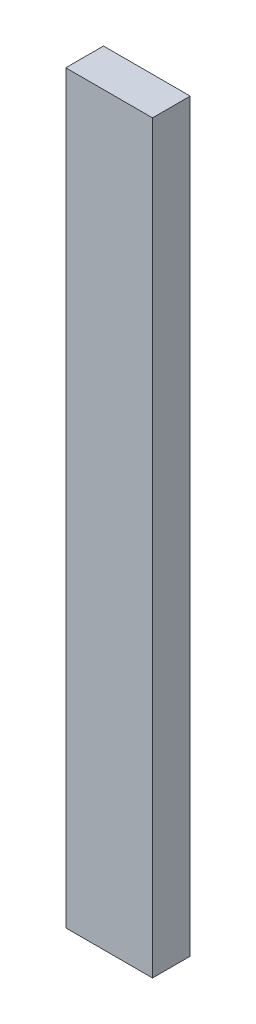
ISO-10303-21;
HEADER;
FILE_DESCRIPTION(('STEP AP214'),'2;1');
FILE_NAME('part.step','',(''),(''),'','','');
FILE_SCHEMA(('AUTOMOTIVE_DESIGN { 1 0 10303 214 1 1 1 1 }'));
ENDSEC;
DATA;
#1=APPLICATION_CONTEXT('core data for automotive mechanical design processes');
#2=APPLICATION_PROTOCOL_DEFINITION('international standard','automotive_design',2000,#1);
#3=PRODUCT_CONTEXT('',#1,'mechanical');
#4=PRODUCT('Part','Part','',(#3));
#5=PRODUCT_RELATED_PRODUCT_CATEGORY('part','',(#4));
#6=PRODUCT_DEFINITION_FORMATION('','',#4);
#7=PRODUCT_DEFINITION_CONTEXT('part definition',#1,'design');
#8=PRODUCT_DEFINITION('design','',#6,#7);
#9=PRODUCT_DEFINITION_SHAPE('','',#8);
#10=(LENGTH_UNIT() NAMED_UNIT(*) SI_UNIT(.MILLI.,.METRE.));
#11=(NAMED_UNIT(*) PLANE_ANGLE_UNIT() SI_UNIT($,.RADIAN.));
#12=(NAMED_UNIT(*) SI_UNIT($,.STERADIAN.) SOLID_ANGLE_UNIT());
#13=UNCERTAINTY_MEASURE_WITH_UNIT(LENGTH_MEASURE(1.E-05),#10,'distance_accuracy_value','');
#14=(GEOMETRIC_REPRESENTATION_CONTEXT(3) GLOBAL_UNCERTAINTY_ASSIGNED_CONTEXT((#13)) GLOBAL_UNIT_ASSIGNED_CONTEXT((#10,
#11,#12)) REPRESENTATION_CONTEXT('',''));
#15=CARTESIAN_POINT('',(0.,0.,0.));
#16=DIRECTION('',(0.,0.,1.));
#17=DIRECTION('',(1.,0.,0.));
#18=AXIS2_PLACEMENT_3D('',#15,#16,#17);
#19=CARTESIAN_POINT('',(23.,395.,10.));
#20=DIRECTION('',(-1.,0.,0.));
#21=DIRECTION('',(0.,0.,1.));
#22=AXIS2_PLACEMENT_3D('',#19,#20,#21);
#23=PLANE('',#22);
#24=DIRECTION('',(0.,0.,-1.));
#25=VECTOR('',#24,1.);
#26=CARTESIAN_POINT('',(23.,0.,10.));
#27=LINE('',#26,#25);
#28=CARTESIAN_POINT('',(23.,0.,10.));
#29=VERTEX_POINT('',#28);
#30=CARTESIAN_POINT('',(23.,0.,-10.));
#31=VERTEX_POINT('',#30);
#32=EDGE_CURVE('E96',#29,#31,#27,.T.);
#33=ORIENTED_EDGE('',*,*,#32,.T.);
#34=DIRECTION('',(0.,-1.,0.));
#35=VECTOR('',#34,1.);
#36=CARTESIAN_POINT('',(23.,395.,-10.));
#37=LINE('',#36,#35);
#38=CARTESIAN_POINT('',(23.,395.,-10.));
#39=VERTEX_POINT('',#38);
#40=EDGE_CURVE('E11',#39,#31,#37,.T.);
#41=ORIENTED_EDGE('',*,*,#40,.F.);
#42=DIRECTION('',(0.,0.,-1.));
#43=VECTOR('',#42,1.);
#44=CARTESIAN_POINT('',(23.,395.,10.));
#45=LINE('',#44,#43);
#46=CARTESIAN_POINT('',(23.,395.,10.));
#47=VERTEX_POINT('',#46);
#48=EDGE_CURVE('E84',#47,#39,#45,.T.);
#49=ORIENTED_EDGE('',*,*,#48,.F.);
#50=DIRECTION('',(0.,-1.,0.));
#51=VECTOR('',#50,1.);
#52=CARTESIAN_POINT('',(23.,395.,10.));
#53=LINE('',#52,#51);
#54=EDGE_CURVE('E92',#47,#29,#53,.T.);
#55=ORIENTED_EDGE('',*,*,#54,.T.);
#56=EDGE_LOOP('',(#33,#41,#49,#55));
#57=FACE_BOUND('',#56,.T.);
#58=ADVANCED_FACE('F33',(#57),#23,.F.);
#59=CARTESIAN_POINT('',(-23.,395.,-10.));
#60=DIRECTION('',(0.,0.,1.));
#61=DIRECTION('',(1.,0.,0.));
#62=AXIS2_PLACEMENT_3D('',#59,#60,#61);
#63=PLANE('',#62);
#64=DIRECTION('',(-1.,0.,0.));
#65=VECTOR('',#64,1.);
#66=CARTESIAN_POINT('',(-23.,0.,-10.));
#67=LINE('',#66,#65);
#68=CARTESIAN_POINT('',(-23.,0.,-10.));
#69=VERTEX_POINT('',#68);
#70=EDGE_CURVE('E88',#31,#69,#67,.T.);
#71=ORIENTED_EDGE('',*,*,#70,.T.);
#72=DIRECTION('',(0.,-1.,0.));
#73=VECTOR('',#72,1.);
#74=CARTESIAN_POINT('',(-23.,395.,-10.));
#75=LINE('',#74,#73);
#76=CARTESIAN_POINT('',(-23.,395.,-10.));
#77=VERTEX_POINT('',#76);
#78=EDGE_CURVE('E41',#77,#69,#75,.T.);
#79=ORIENTED_EDGE('',*,*,#78,.F.);
#80=DIRECTION('',(-1.,0.,0.));
#81=VECTOR('',#80,1.);
#82=CARTESIAN_POINT('',(-23.,395.,-10.));
#83=LINE('',#82,#81);
#84=EDGE_CURVE('E79',#39,#77,#83,.T.);
#85=ORIENTED_EDGE('',*,*,#84,.F.);
#86=ORIENTED_EDGE('',*,*,#40,.T.);
#87=EDGE_LOOP('',(#71,#79,#85,#86));
#88=FACE_BOUND('',#87,.T.);
#89=ADVANCED_FACE('F87',(#88),#63,.F.);
#90=CARTESIAN_POINT('',(-23.,395.,10.));
#91=DIRECTION('',(1.,0.,0.));
#92=DIRECTION('',(0.,0.,-1.));
#93=AXIS2_PLACEMENT_3D('',#90,#91,#92);
#94=PLANE('',#93);
#95=DIRECTION('',(0.,0.,1.));
#96=VECTOR('',#95,1.);
#97=CARTESIAN_POINT('',(-23.,0.,10.));
#98=LINE('',#97,#96);
#99=CARTESIAN_POINT('',(-23.,0.,10.));
#100=VERTEX_POINT('',#99);
#101=EDGE_CURVE('E66',#69,#100,#98,.T.);
#102=ORIENTED_EDGE('',*,*,#101,.T.);
#103=DIRECTION('',(0.,-1.,0.));
#104=VECTOR('',#103,1.);
#105=CARTESIAN_POINT('',(-23.,395.,10.));
#106=LINE('',#105,#104);
#107=CARTESIAN_POINT('',(-23.,395.,10.));
#108=VERTEX_POINT('',#107);
#109=EDGE_CURVE('E89',#108,#100,#106,.T.);
#110=ORIENTED_EDGE('',*,*,#109,.F.);
#111=DIRECTION('',(0.,0.,1.));
#112=VECTOR('',#111,1.);
#113=CARTESIAN_POINT('',(-23.,395.,10.));
#114=LINE('',#113,#112);
#115=EDGE_CURVE('E82',#77,#108,#114,.T.);
#116=ORIENTED_EDGE('',*,*,#115,.F.);
#117=ORIENTED_EDGE('',*,*,#78,.T.);
#118=EDGE_LOOP('',(#102,#110,#116,#117));
#119=FACE_BOUND('',#118,.T.);
#120=ADVANCED_FACE('F90',(#119),#94,.F.);
#121=CARTESIAN_POINT('',(-23.,395.,10.));
#122=DIRECTION('',(0.,0.,-1.));
#123=DIRECTION('',(-1.,0.,0.));
#124=AXIS2_PLACEMENT_3D('',#121,#122,#123);
#125=PLANE('',#124);
#126=DIRECTION('',(1.,0.,0.));
#127=VECTOR('',#126,1.);
#128=CARTESIAN_POINT('',(-23.,0.,10.));
#129=LINE('',#128,#127);
#130=EDGE_CURVE('E72',#100,#29,#129,.T.);
#131=ORIENTED_EDGE('',*,*,#130,.T.);
#132=ORIENTED_EDGE('',*,*,#54,.F.);
#133=DIRECTION('',(1.,0.,0.));
#134=VECTOR('',#133,1.);
#135=CARTESIAN_POINT('',(-23.,395.,10.));
#136=LINE('',#135,#134);
#137=EDGE_CURVE('E49',#108,#47,#136,.T.);
#138=ORIENTED_EDGE('',*,*,#137,.F.);
#139=ORIENTED_EDGE('',*,*,#109,.T.);
#140=EDGE_LOOP('',(#131,#132,#138,#139));
#141=FACE_BOUND('',#140,.T.);
#142=ADVANCED_FACE('F103',(#141),#125,.F.);
#143=CARTESIAN_POINT('',(0.,395.,0.));
#144=DIRECTION('',(0.,-1.,0.));
#145=DIRECTION('',(0.,0.,-1.));
#146=AXIS2_PLACEMENT_3D('',#143,#144,#145);
#147=PLANE('',#146);
#148=ORIENTED_EDGE('',*,*,#48,.T.);
#149=ORIENTED_EDGE('',*,*,#84,.T.);
#150=ORIENTED_EDGE('',*,*,#115,.T.);
#151=ORIENTED_EDGE('',*,*,#137,.T.);
#152=EDGE_LOOP('',(#148,#149,#150,#151));
#153=FACE_BOUND('',#152,.T.);
#154=ADVANCED_FACE('F80',(#153),#147,.F.);
#155=CARTESIAN_POINT('',(0.,0.,0.));
#156=DIRECTION('',(0.,-1.,0.));
#157=DIRECTION('',(0.,0.,-1.));
#158=AXIS2_PLACEMENT_3D('',#155,#156,#157);
#159=PLANE('',#158);
#160=ORIENTED_EDGE('',*,*,#32,.F.);
#161=ORIENTED_EDGE('',*,*,#130,.F.);
#162=ORIENTED_EDGE('',*,*,#101,.F.);
#163=ORIENTED_EDGE('',*,*,#70,.F.);
#164=EDGE_LOOP('',(#160,#161,#162,#163));
#165=FACE_BOUND('',#164,.T.);
#166=ADVANCED_FACE('F106',(#165),#159,.T.);
#167=CLOSED_SHELL('',(#58,#89,#120,#142,#154,#166));
#168=MANIFOLD_SOLID_BREP('B2',#167);
#169=ADVANCED_BREP_SHAPE_REPRESENTATION('',(#18,#168),#14);
#170=SHAPE_DEFINITION_REPRESENTATION(#9,#169);
ENDSEC;
END-ISO-10303-21;
